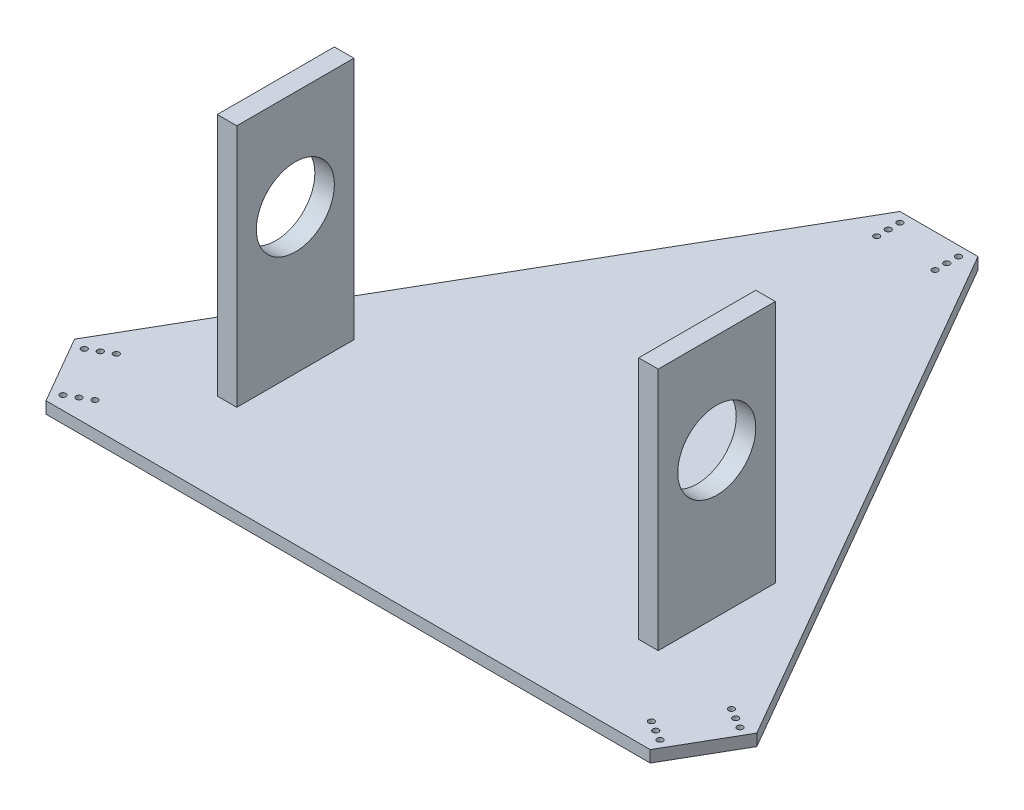
ISO-10303-21;
HEADER;
FILE_DESCRIPTION(('STEP AP214'),'2;1');
FILE_NAME('part.step','',(''),(''),'','','');
FILE_SCHEMA(('AUTOMOTIVE_DESIGN { 1 0 10303 214 1 1 1 1 }'));
ENDSEC;
DATA;
#1=APPLICATION_CONTEXT('core data for automotive mechanical design processes');
#2=APPLICATION_PROTOCOL_DEFINITION('international standard','automotive_design',2000,#1);
#3=PRODUCT_CONTEXT('',#1,'mechanical');
#4=PRODUCT('Part','Part','',(#3));
#5=PRODUCT_RELATED_PRODUCT_CATEGORY('part','',(#4));
#6=PRODUCT_DEFINITION_FORMATION('','',#4);
#7=PRODUCT_DEFINITION_CONTEXT('part definition',#1,'design');
#8=PRODUCT_DEFINITION('design','',#6,#7);
#9=PRODUCT_DEFINITION_SHAPE('','',#8);
#10=(LENGTH_UNIT() NAMED_UNIT(*) SI_UNIT(.MILLI.,.METRE.));
#11=(NAMED_UNIT(*) PLANE_ANGLE_UNIT() SI_UNIT($,.RADIAN.));
#12=(NAMED_UNIT(*) SI_UNIT($,.STERADIAN.) SOLID_ANGLE_UNIT());
#13=UNCERTAINTY_MEASURE_WITH_UNIT(LENGTH_MEASURE(1.E-05),#10,'distance_accuracy_value','');
#14=(GEOMETRIC_REPRESENTATION_CONTEXT(3) GLOBAL_UNCERTAINTY_ASSIGNED_CONTEXT((#13)) GLOBAL_UNIT_ASSIGNED_CONTEXT((#10,
#11,#12)) REPRESENTATION_CONTEXT('',''));
#15=CARTESIAN_POINT('',(0.,0.,0.));
#16=DIRECTION('',(0.,0.,1.));
#17=DIRECTION('',(1.,0.,0.));
#18=AXIS2_PLACEMENT_3D('',#15,#16,#17);
#19=CARTESIAN_POINT('',(0.,6.,0.));
#20=DIRECTION('',(0.,1.,0.));
#21=DIRECTION('',(0.,0.,1.));
#22=AXIS2_PLACEMENT_3D('',#19,#20,#21);
#23=PLANE('',#22);
#24=DIRECTION('',(1.,0.,0.));
#25=VECTOR('',#24,1.);
#26=CARTESIAN_POINT('',(103.,6.,6.54767863978529));
#27=LINE('',#26,#25);
#28=CARTESIAN_POINT('',(103.,6.,6.54767863978529));
#29=VERTEX_POINT('',#28);
#30=CARTESIAN_POINT('',(113.,6.,6.54767863978528));
#31=VERTEX_POINT('',#30);
#32=EDGE_CURVE('E141',#29,#31,#27,.T.);
#33=ORIENTED_EDGE('',*,*,#32,.T.);
#34=DIRECTION('',(0.,0.,1.));
#35=VECTOR('',#34,1.);
#36=CARTESIAN_POINT('',(113.,6.,6.54767863978528));
#37=LINE('',#36,#35);
#38=CARTESIAN_POINT('',(113.,6.,66.5476786397853));
#39=VERTEX_POINT('',#38);
#40=EDGE_CURVE('E180',#31,#39,#37,.T.);
#41=ORIENTED_EDGE('',*,*,#40,.T.);
#42=DIRECTION('',(1.,0.,0.));
#43=VECTOR('',#42,1.);
#44=CARTESIAN_POINT('',(103.,6.,66.5476786397853));
#45=LINE('',#44,#43);
#46=CARTESIAN_POINT('',(103.,6.,66.5476786397853));
#47=VERTEX_POINT('',#46);
#48=EDGE_CURVE('E182',#47,#39,#45,.T.);
#49=ORIENTED_EDGE('',*,*,#48,.F.);
#50=DIRECTION('',(0.,0.,1.));
#51=VECTOR('',#50,1.);
#52=CARTESIAN_POINT('',(103.,6.,6.54767863978529));
#53=LINE('',#52,#51);
#54=EDGE_CURVE('E171',#29,#47,#53,.T.);
#55=ORIENTED_EDGE('',*,*,#54,.F.);
#56=EDGE_LOOP('',(#33,#41,#49,#55));
#57=FACE_BOUND('',#56,.T.);
#58=CARTESIAN_POINT('',(-157.633283992223,6.,73.6891108704658));
#59=DIRECTION('',(0.,1.,0.));
#60=DIRECTION('',(0.,0.,1.));
#61=AXIS2_PLACEMENT_3D('',#58,#59,#60);
#62=CIRCLE('',#61,1.5);
#63=CARTESIAN_POINT('',(-157.633283992223,6.,75.1891108704658));
#64=VERTEX_POINT('',#63);
#65=EDGE_CURVE('E190',#64,#64,#62,.T.);
#66=ORIENTED_EDGE('',*,*,#65,.F.);
#67=EDGE_LOOP('',(#66));
#68=FACE_BOUND('',#67,.T.);
#69=CARTESIAN_POINT('',(-162.829436414929,6.,76.6891108704658));
#70=DIRECTION('',(0.,1.,0.));
#71=DIRECTION('',(0.,0.,1.));
#72=AXIS2_PLACEMENT_3D('',#69,#70,#71);
#73=CIRCLE('',#72,1.5);
#74=CARTESIAN_POINT('',(-162.829436414929,6.,78.1891108704658));
#75=VERTEX_POINT('',#74);
#76=EDGE_CURVE('E202',#75,#75,#73,.T.);
#77=ORIENTED_EDGE('',*,*,#76,.F.);
#78=EDGE_LOOP('',(#77));
#79=FACE_BOUND('',#78,.T.);
#80=CARTESIAN_POINT('',(-142.633283992223,6.,99.6698729839988));
#81=DIRECTION('',(0.,1.,0.));
#82=DIRECTION('',(0.,0.,1.));
#83=AXIS2_PLACEMENT_3D('',#80,#81,#82);
#84=CIRCLE('',#83,1.5);
#85=CARTESIAN_POINT('',(-142.633283992223,6.,101.169872983999));
#86=VERTEX_POINT('',#85);
#87=EDGE_CURVE('E208',#86,#86,#84,.T.);
#88=ORIENTED_EDGE('',*,*,#87,.F.);
#89=EDGE_LOOP('',(#88));
#90=FACE_BOUND('',#89,.T.);
#91=CARTESIAN_POINT('',(-147.829436414929,6.,102.669872983999));
#92=DIRECTION('',(0.,1.,0.));
#93=DIRECTION('',(0.,0.,1.));
#94=AXIS2_PLACEMENT_3D('',#91,#92,#93);
#95=CIRCLE('',#94,1.5);
#96=CARTESIAN_POINT('',(-147.829436414929,6.,104.169872983999));
#97=VERTEX_POINT('',#96);
#98=EDGE_CURVE('E214',#97,#97,#95,.T.);
#99=ORIENTED_EDGE('',*,*,#98,.F.);
#100=EDGE_LOOP('',(#99));
#101=FACE_BOUND('',#100,.T.);
#102=CARTESIAN_POINT('',(-153.025588837636,6.,105.669872983999));
#103=DIRECTION('',(0.,1.,0.));
#104=DIRECTION('',(0.,0.,1.));
#105=AXIS2_PLACEMENT_3D('',#102,#103,#104);
#106=CIRCLE('',#105,1.5);
#107=CARTESIAN_POINT('',(-153.025588837636,6.,107.169872983999));
#108=VERTEX_POINT('',#107);
#109=EDGE_CURVE('E220',#108,#108,#106,.T.);
#110=ORIENTED_EDGE('',*,*,#109,.F.);
#111=EDGE_LOOP('',(#110));
#112=FACE_BOUND('',#111,.T.);
#113=CARTESIAN_POINT('',(-168.025588837636,6.,79.6891108704658));
#114=DIRECTION('',(0.,1.,0.));
#115=DIRECTION('',(0.,0.,1.));
#116=AXIS2_PLACEMENT_3D('',#113,#114,#115);
#117=CIRCLE('',#116,1.5);
#118=CARTESIAN_POINT('',(-168.025588837636,6.,81.1891108704659));
#119=VERTEX_POINT('',#118);
#120=EDGE_CURVE('E226',#119,#119,#117,.T.);
#121=ORIENTED_EDGE('',*,*,#120,.F.);
#122=EDGE_LOOP('',(#121));
#123=FACE_BOUND('',#122,.T.);
#124=CARTESIAN_POINT('',(142.633283992223,6.,99.669872983999));
#125=DIRECTION('',(0.,1.,0.));
#126=DIRECTION('',(0.,0.,1.));
#127=AXIS2_PLACEMENT_3D('',#124,#125,#126);
#128=CIRCLE('',#127,1.5);
#129=CARTESIAN_POINT('',(142.633283992223,6.,101.169872983999));
#130=VERTEX_POINT('',#129);
#131=EDGE_CURVE('E232',#130,#130,#128,.T.);
#132=ORIENTED_EDGE('',*,*,#131,.F.);
#133=EDGE_LOOP('',(#132));
#134=FACE_BOUND('',#133,.T.);
#135=CARTESIAN_POINT('',(147.829436414929,6.,102.669872983999));
#136=DIRECTION('',(0.,1.,0.));
#137=DIRECTION('',(0.,0.,1.));
#138=AXIS2_PLACEMENT_3D('',#135,#136,#137);
#139=CIRCLE('',#138,1.5);
#140=CARTESIAN_POINT('',(147.829436414929,6.,104.169872983999));
#141=VERTEX_POINT('',#140);
#142=EDGE_CURVE('E238',#141,#141,#139,.T.);
#143=ORIENTED_EDGE('',*,*,#142,.F.);
#144=EDGE_LOOP('',(#143));
#145=FACE_BOUND('',#144,.T.);
#146=CARTESIAN_POINT('',(157.633283992223,6.,73.6891108704658));
#147=DIRECTION('',(0.,1.,0.));
#148=DIRECTION('',(0.,0.,1.));
#149=AXIS2_PLACEMENT_3D('',#146,#147,#148);
#150=CIRCLE('',#149,1.5);
#151=CARTESIAN_POINT('',(157.633283992223,6.,75.1891108704658));
#152=VERTEX_POINT('',#151);
#153=EDGE_CURVE('E244',#152,#152,#150,.T.);
#154=ORIENTED_EDGE('',*,*,#153,.F.);
#155=EDGE_LOOP('',(#154));
#156=FACE_BOUND('',#155,.T.);
#157=CARTESIAN_POINT('',(162.829436414929,6.,76.6891108704657));
#158=DIRECTION('',(0.,1.,0.));
#159=DIRECTION('',(0.,0.,1.));
#160=AXIS2_PLACEMENT_3D('',#157,#158,#159);
#161=CIRCLE('',#160,1.5);
#162=CARTESIAN_POINT('',(162.829436414929,6.,78.1891108704657));
#163=VERTEX_POINT('',#162);
#164=EDGE_CURVE('E250',#163,#163,#161,.T.);
#165=ORIENTED_EDGE('',*,*,#164,.F.);
#166=EDGE_LOOP('',(#165));
#167=FACE_BOUND('',#166,.T.);
#168=CARTESIAN_POINT('',(168.025588837636,6.,79.6891108704656));
#169=DIRECTION('',(0.,1.,0.));
#170=DIRECTION('',(0.,0.,1.));
#171=AXIS2_PLACEMENT_3D('',#168,#169,#170);
#172=CIRCLE('',#171,1.5);
#173=CARTESIAN_POINT('',(168.025588837636,6.,81.1891108704656));
#174=VERTEX_POINT('',#173);
#175=EDGE_CURVE('E256',#174,#174,#172,.T.);
#176=ORIENTED_EDGE('',*,*,#175,.F.);
#177=EDGE_LOOP('',(#176));
#178=FACE_BOUND('',#177,.T.);
#179=CARTESIAN_POINT('',(153.025588837636,6.,105.669872983999));
#180=DIRECTION('',(0.,1.,0.));
#181=DIRECTION('',(0.,0.,1.));
#182=AXIS2_PLACEMENT_3D('',#179,#180,#181);
#183=CIRCLE('',#182,1.5);
#184=CARTESIAN_POINT('',(153.025588837636,6.,107.169872983999));
#185=VERTEX_POINT('',#184);
#186=EDGE_CURVE('E262',#185,#185,#183,.T.);
#187=ORIENTED_EDGE('',*,*,#186,.F.);
#188=EDGE_LOOP('',(#187));
#189=FACE_BOUND('',#188,.T.);
#190=CARTESIAN_POINT('',(15.0000000000001,6.,-173.358983854465));
#191=DIRECTION('',(0.,1.,0.));
#192=DIRECTION('',(0.,0.,1.));
#193=AXIS2_PLACEMENT_3D('',#190,#191,#192);
#194=CIRCLE('',#193,1.5);
#195=CARTESIAN_POINT('',(15.0000000000001,6.,-171.858983854465));
#196=VERTEX_POINT('',#195);
#197=EDGE_CURVE('E268',#196,#196,#194,.T.);
#198=ORIENTED_EDGE('',*,*,#197,.F.);
#199=EDGE_LOOP('',(#198));
#200=FACE_BOUND('',#199,.T.);
#201=CARTESIAN_POINT('',(15.0000000000001,6.,-179.358983854465));
#202=DIRECTION('',(0.,1.,0.));
#203=DIRECTION('',(0.,0.,1.));
#204=AXIS2_PLACEMENT_3D('',#201,#202,#203);
#205=CIRCLE('',#204,1.5);
#206=CARTESIAN_POINT('',(15.0000000000001,6.,-177.858983854465));
#207=VERTEX_POINT('',#206);
#208=EDGE_CURVE('E274',#207,#207,#205,.T.);
#209=ORIENTED_EDGE('',*,*,#208,.F.);
#210=EDGE_LOOP('',(#209));
#211=FACE_BOUND('',#210,.T.);
#212=CARTESIAN_POINT('',(-14.9999999999999,6.,-173.358983854465));
#213=DIRECTION('',(0.,1.,0.));
#214=DIRECTION('',(0.,0.,1.));
#215=AXIS2_PLACEMENT_3D('',#212,#213,#214);
#216=CIRCLE('',#215,1.5);
#217=CARTESIAN_POINT('',(-14.9999999999999,6.,-171.858983854465));
#218=VERTEX_POINT('',#217);
#219=EDGE_CURVE('E280',#218,#218,#216,.T.);
#220=ORIENTED_EDGE('',*,*,#219,.F.);
#221=EDGE_LOOP('',(#220));
#222=FACE_BOUND('',#221,.T.);
#223=CARTESIAN_POINT('',(-14.9999999999999,6.,-179.358983854465));
#224=DIRECTION('',(0.,1.,0.));
#225=DIRECTION('',(0.,0.,1.));
#226=AXIS2_PLACEMENT_3D('',#223,#224,#225);
#227=CIRCLE('',#226,1.5);
#228=CARTESIAN_POINT('',(-14.9999999999999,6.,-177.858983854465));
#229=VERTEX_POINT('',#228);
#230=EDGE_CURVE('E286',#229,#229,#227,.T.);
#231=ORIENTED_EDGE('',*,*,#230,.F.);
#232=EDGE_LOOP('',(#231));
#233=FACE_BOUND('',#232,.T.);
#234=CARTESIAN_POINT('',(-15.,6.,-185.358983854464));
#235=DIRECTION('',(0.,1.,0.));
#236=DIRECTION('',(0.,0.,1.));
#237=AXIS2_PLACEMENT_3D('',#234,#235,#236);
#238=CIRCLE('',#237,1.5);
#239=CARTESIAN_POINT('',(-15.,6.,-183.858983854464));
#240=VERTEX_POINT('',#239);
#241=EDGE_CURVE('E292',#240,#240,#238,.T.);
#242=ORIENTED_EDGE('',*,*,#241,.F.);
#243=EDGE_LOOP('',(#242));
#244=FACE_BOUND('',#243,.T.);
#245=CARTESIAN_POINT('',(15.,6.,-185.358983854465));
#246=DIRECTION('',(0.,1.,0.));
#247=DIRECTION('',(0.,0.,1.));
#248=AXIS2_PLACEMENT_3D('',#245,#246,#247);
#249=CIRCLE('',#248,1.5);
#250=CARTESIAN_POINT('',(15.,6.,-183.858983854465));
#251=VERTEX_POINT('',#250);
#252=EDGE_CURVE('E298',#251,#251,#249,.T.);
#253=ORIENTED_EDGE('',*,*,#252,.F.);
#254=EDGE_LOOP('',(#253));
#255=FACE_BOUND('',#254,.T.);
#256=DIRECTION('',(1.,0.,0.));
#257=VECTOR('',#256,1.);
#258=CARTESIAN_POINT('',(-20.,6.,-190.358983854465));
#259=LINE('',#258,#257);
#260=CARTESIAN_POINT('',(-20.,6.,-190.358983854465));
#261=VERTEX_POINT('',#260);
#262=CARTESIAN_POINT('',(20.,6.,-190.358983854465));
#263=VERTEX_POINT('',#262);
#264=EDGE_CURVE('E307',#261,#263,#259,.T.);
#265=ORIENTED_EDGE('',*,*,#264,.F.);
#266=DIRECTION('',(-0.5,0.,0.866025403784439));
#267=VECTOR('',#266,1.);
#268=CARTESIAN_POINT('',(-20.,6.,-190.358983854465));
#269=LINE('',#268,#267);
#270=CARTESIAN_POINT('',(-174.855715856558,6.,77.8589838515431));
#271=VERTEX_POINT('',#270);
#272=EDGE_CURVE('E321',#261,#271,#269,.T.);
#273=ORIENTED_EDGE('',*,*,#272,.T.);
#274=DIRECTION('',(-0.499999999999999,0.,-0.866025403784439));
#275=VECTOR('',#274,1.);
#276=CARTESIAN_POINT('',(-154.855715856558,6.,112.500000002921));
#277=LINE('',#276,#275);
#278=CARTESIAN_POINT('',(-154.855715856558,6.,112.500000002921));
#279=VERTEX_POINT('',#278);
#280=EDGE_CURVE('E318',#279,#271,#277,.T.);
#281=ORIENTED_EDGE('',*,*,#280,.F.);
#282=DIRECTION('',(1.,0.,0.));
#283=VECTOR('',#282,1.);
#284=CARTESIAN_POINT('',(-154.855715856558,6.,112.500000002921));
#285=LINE('',#284,#283);
#286=CARTESIAN_POINT('',(154.855715856558,6.,112.500000002921));
#287=VERTEX_POINT('',#286);
#288=EDGE_CURVE('E316',#279,#287,#285,.T.);
#289=ORIENTED_EDGE('',*,*,#288,.T.);
#290=DIRECTION('',(-0.500000000000001,0.,0.866025403784438));
#291=VECTOR('',#290,1.);
#292=CARTESIAN_POINT('',(174.855715856558,6.,77.8589838515431));
#293=LINE('',#292,#291);
#294=CARTESIAN_POINT('',(174.855715856558,6.,77.8589838515431));
#295=VERTEX_POINT('',#294);
#296=EDGE_CURVE('E313',#295,#287,#293,.T.);
#297=ORIENTED_EDGE('',*,*,#296,.F.);
#298=DIRECTION('',(-0.5,0.,-0.866025403784439));
#299=VECTOR('',#298,1.);
#300=CARTESIAN_POINT('',(174.855715856558,6.,77.8589838515431));
#301=LINE('',#300,#299);
#302=EDGE_CURVE('E310',#295,#263,#301,.T.);
#303=ORIENTED_EDGE('',*,*,#302,.T.);
#304=EDGE_LOOP('',(#265,#273,#281,#289,#297,#303));
#305=FACE_BOUND('',#304,.T.);
#306=DIRECTION('',(0.,0.,1.));
#307=VECTOR('',#306,1.);
#308=CARTESIAN_POINT('',(-113.,6.,6.54767863978528));
#309=LINE('',#308,#307);
#310=CARTESIAN_POINT('',(-113.,6.,6.54767863978528));
#311=VERTEX_POINT('',#310);
#312=CARTESIAN_POINT('',(-113.,6.,66.5476786397853));
#313=VERTEX_POINT('',#312);
#314=EDGE_CURVE('E52',#311,#313,#309,.T.);
#315=ORIENTED_EDGE('',*,*,#314,.F.);
#316=DIRECTION('',(-1.,0.,0.));
#317=VECTOR('',#316,1.);
#318=CARTESIAN_POINT('',(-103.,6.,6.54767863978529));
#319=LINE('',#318,#317);
#320=CARTESIAN_POINT('',(-103.,6.,6.54767863978529));
#321=VERTEX_POINT('',#320);
#322=EDGE_CURVE('E134',#321,#311,#319,.T.);
#323=ORIENTED_EDGE('',*,*,#322,.F.);
#324=DIRECTION('',(0.,0.,1.));
#325=VECTOR('',#324,1.);
#326=CARTESIAN_POINT('',(-103.,6.,6.54767863978529));
#327=LINE('',#326,#325);
#328=CARTESIAN_POINT('',(-103.,6.,66.5476786397853));
#329=VERTEX_POINT('',#328);
#330=EDGE_CURVE('E137',#321,#329,#327,.T.);
#331=ORIENTED_EDGE('',*,*,#330,.T.);
#332=DIRECTION('',(-1.,0.,0.));
#333=VECTOR('',#332,1.);
#334=CARTESIAN_POINT('',(-103.,6.,66.5476786397853));
#335=LINE('',#334,#333);
#336=EDGE_CURVE('E57',#329,#313,#335,.T.);
#337=ORIENTED_EDGE('',*,*,#336,.T.);
#338=EDGE_LOOP('',(#315,#323,#331,#337));
#339=FACE_BOUND('',#338,.T.);
#340=ADVANCED_FACE('F35',(#57,#68,#79,#90,#101,#112,#123,#134,#145,#156,#167,#178,#189,#200,
#211,#222,#233,#244,#255,#305,#339),#23,.T.);
#341=CARTESIAN_POINT('',(-20.,6.,-190.358983854465));
#342=DIRECTION('',(0.,0.,-1.));
#343=DIRECTION('',(-1.,0.,0.));
#344=AXIS2_PLACEMENT_3D('',#341,#342,#343);
#345=PLANE('',#344);
#346=DIRECTION('',(1.,0.,0.));
#347=VECTOR('',#346,1.);
#348=CARTESIAN_POINT('',(-20.,0.,-190.358983854465));
#349=LINE('',#348,#347);
#350=CARTESIAN_POINT('',(-20.,0.,-190.358983854465));
#351=VERTEX_POINT('',#350);
#352=CARTESIAN_POINT('',(20.,0.,-190.358983854465));
#353=VERTEX_POINT('',#352);
#354=EDGE_CURVE('E304',#351,#353,#349,.T.);
#355=ORIENTED_EDGE('',*,*,#354,.F.);
#356=DIRECTION('',(0.,-1.,0.));
#357=VECTOR('',#356,1.);
#358=CARTESIAN_POINT('',(-20.,6.,-190.358983854465));
#359=LINE('',#358,#357);
#360=EDGE_CURVE('E11',#261,#351,#359,.T.);
#361=ORIENTED_EDGE('',*,*,#360,.F.);
#362=ORIENTED_EDGE('',*,*,#264,.T.);
#363=DIRECTION('',(0.,-1.,0.));
#364=VECTOR('',#363,1.);
#365=CARTESIAN_POINT('',(20.,6.,-190.358983854465));
#366=LINE('',#365,#364);
#367=EDGE_CURVE('E323',#263,#353,#366,.T.);
#368=ORIENTED_EDGE('',*,*,#367,.T.);
#369=EDGE_LOOP('',(#355,#361,#362,#368));
#370=FACE_BOUND('',#369,.T.);
#371=ADVANCED_FACE('F37',(#370),#345,.T.);
#372=CARTESIAN_POINT('',(-20.,6.,-190.358983854465));
#373=DIRECTION('',(0.866025403784439,0.,0.5));
#374=DIRECTION('',(0.5,0.,-0.866025403784439));
#375=AXIS2_PLACEMENT_3D('',#372,#373,#374);
#376=PLANE('',#375);
#377=DIRECTION('',(-0.5,0.,0.866025403784439));
#378=VECTOR('',#377,1.);
#379=CARTESIAN_POINT('',(-20.,0.,-190.358983854465));
#380=LINE('',#379,#378);
#381=CARTESIAN_POINT('',(-174.855715856558,0.,77.8589838515431));
#382=VERTEX_POINT('',#381);
#383=EDGE_CURVE('E311',#351,#382,#380,.T.);
#384=ORIENTED_EDGE('',*,*,#383,.T.);
#385=DIRECTION('',(0.,-1.,0.));
#386=VECTOR('',#385,1.);
#387=CARTESIAN_POINT('',(-174.855715856558,6.,77.8589838515431));
#388=LINE('',#387,#386);
#389=EDGE_CURVE('E44',#271,#382,#388,.T.);
#390=ORIENTED_EDGE('',*,*,#389,.F.);
#391=ORIENTED_EDGE('',*,*,#272,.F.);
#392=ORIENTED_EDGE('',*,*,#360,.T.);
#393=EDGE_LOOP('',(#384,#390,#391,#392));
#394=FACE_BOUND('',#393,.T.);
#395=ADVANCED_FACE('F362',(#394),#376,.F.);
#396=CARTESIAN_POINT('',(-154.855715856558,6.,112.500000002921));
#397=DIRECTION('',(-0.866025403784439,0.,0.499999999999999));
#398=DIRECTION('',(0.499999999999999,0.,0.866025403784439));
#399=AXIS2_PLACEMENT_3D('',#396,#397,#398);
#400=PLANE('',#399);
#401=DIRECTION('',(-0.499999999999999,0.,-0.866025403784439));
#402=VECTOR('',#401,1.);
#403=CARTESIAN_POINT('',(-154.855715856558,0.,112.500000002921));
#404=LINE('',#403,#402);
#405=CARTESIAN_POINT('',(-154.855715856558,0.,112.500000002921));
#406=VERTEX_POINT('',#405);
#407=EDGE_CURVE('E335',#406,#382,#404,.T.);
#408=ORIENTED_EDGE('',*,*,#407,.F.);
#409=DIRECTION('',(0.,-1.,0.));
#410=VECTOR('',#409,1.);
#411=CARTESIAN_POINT('',(-154.855715856558,6.,112.500000002921));
#412=LINE('',#411,#410);
#413=EDGE_CURVE('E341',#279,#406,#412,.T.);
#414=ORIENTED_EDGE('',*,*,#413,.F.);
#415=ORIENTED_EDGE('',*,*,#280,.T.);
#416=ORIENTED_EDGE('',*,*,#389,.T.);
#417=EDGE_LOOP('',(#408,#414,#415,#416));
#418=FACE_BOUND('',#417,.T.);
#419=ADVANCED_FACE('F373',(#418),#400,.T.);
#420=CARTESIAN_POINT('',(-154.855715856558,6.,112.500000002921));
#421=DIRECTION('',(0.,0.,-1.));
#422=DIRECTION('',(-1.,0.,0.));
#423=AXIS2_PLACEMENT_3D('',#420,#421,#422);
#424=PLANE('',#423);
#425=DIRECTION('',(1.,0.,0.));
#426=VECTOR('',#425,1.);
#427=CARTESIAN_POINT('',(-154.855715856558,0.,112.500000002921));
#428=LINE('',#427,#426);
#429=CARTESIAN_POINT('',(154.855715856558,0.,112.500000002921));
#430=VERTEX_POINT('',#429);
#431=EDGE_CURVE('E332',#406,#430,#428,.T.);
#432=ORIENTED_EDGE('',*,*,#431,.T.);
#433=DIRECTION('',(0.,-1.,0.));
#434=VECTOR('',#433,1.);
#435=CARTESIAN_POINT('',(154.855715856558,6.,112.500000002921));
#436=LINE('',#435,#434);
#437=EDGE_CURVE('E343',#287,#430,#436,.T.);
#438=ORIENTED_EDGE('',*,*,#437,.F.);
#439=ORIENTED_EDGE('',*,*,#288,.F.);
#440=ORIENTED_EDGE('',*,*,#413,.T.);
#441=EDGE_LOOP('',(#432,#438,#439,#440));
#442=FACE_BOUND('',#441,.T.);
#443=ADVANCED_FACE('F374',(#442),#424,.F.);
#444=CARTESIAN_POINT('',(174.855715856558,6.,77.8589838515431));
#445=DIRECTION('',(0.866025403784438,0.,0.500000000000001));
#446=DIRECTION('',(0.500000000000001,0.,-0.866025403784438));
#447=AXIS2_PLACEMENT_3D('',#444,#445,#446);
#448=PLANE('',#447);
#449=DIRECTION('',(-0.500000000000001,0.,0.866025403784438));
#450=VECTOR('',#449,1.);
#451=CARTESIAN_POINT('',(174.855715856558,0.,77.8589838515431));
#452=LINE('',#451,#450);
#453=CARTESIAN_POINT('',(174.855715856558,0.,77.8589838515431));
#454=VERTEX_POINT('',#453);
#455=EDGE_CURVE('E329',#454,#430,#452,.T.);
#456=ORIENTED_EDGE('',*,*,#455,.F.);
#457=DIRECTION('',(0.,-1.,0.));
#458=VECTOR('',#457,1.);
#459=CARTESIAN_POINT('',(174.855715856558,6.,77.8589838515431));
#460=LINE('',#459,#458);
#461=EDGE_CURVE('E345',#295,#454,#460,.T.);
#462=ORIENTED_EDGE('',*,*,#461,.F.);
#463=ORIENTED_EDGE('',*,*,#296,.T.);
#464=ORIENTED_EDGE('',*,*,#437,.T.);
#465=EDGE_LOOP('',(#456,#462,#463,#464));
#466=FACE_BOUND('',#465,.T.);
#467=ADVANCED_FACE('F370',(#466),#448,.T.);
#468=CARTESIAN_POINT('',(174.855715856558,6.,77.8589838515431));
#469=DIRECTION('',(-0.866025403784438,0.,0.5));
#470=DIRECTION('',(0.5,0.,0.866025403784439));
#471=AXIS2_PLACEMENT_3D('',#468,#469,#470);
#472=PLANE('',#471);
#473=DIRECTION('',(-0.5,0.,-0.866025403784439));
#474=VECTOR('',#473,1.);
#475=CARTESIAN_POINT('',(174.855715856558,0.,77.8589838515431));
#476=LINE('',#475,#474);
#477=EDGE_CURVE('E326',#454,#353,#476,.T.);
#478=ORIENTED_EDGE('',*,*,#477,.T.);
#479=ORIENTED_EDGE('',*,*,#367,.F.);
#480=ORIENTED_EDGE('',*,*,#302,.F.);
#481=ORIENTED_EDGE('',*,*,#461,.T.);
#482=EDGE_LOOP('',(#478,#479,#480,#481));
#483=FACE_BOUND('',#482,.T.);
#484=ADVANCED_FACE('F353',(#483),#472,.F.);
#485=CARTESIAN_POINT('',(0.,0.,0.));
#486=DIRECTION('',(0.,1.,0.));
#487=DIRECTION('',(0.,0.,1.));
#488=AXIS2_PLACEMENT_3D('',#485,#486,#487);
#489=PLANE('',#488);
#490=CARTESIAN_POINT('',(-157.633283992223,0.,73.6891108704658));
#491=DIRECTION('',(0.,1.,0.));
#492=DIRECTION('',(0.,0.,1.));
#493=AXIS2_PLACEMENT_3D('',#490,#491,#492);
#494=CIRCLE('',#493,1.5);
#495=CARTESIAN_POINT('',(-157.633283992223,0.,75.1891108704658));
#496=VERTEX_POINT('',#495);
#497=EDGE_CURVE('E199',#496,#496,#494,.T.);
#498=ORIENTED_EDGE('',*,*,#497,.T.);
#499=EDGE_LOOP('',(#498));
#500=FACE_BOUND('',#499,.T.);
#501=CARTESIAN_POINT('',(-162.829436414929,0.,76.6891108704658));
#502=DIRECTION('',(0.,1.,0.));
#503=DIRECTION('',(0.,0.,1.));
#504=AXIS2_PLACEMENT_3D('',#501,#502,#503);
#505=CIRCLE('',#504,1.5);
#506=CARTESIAN_POINT('',(-162.829436414929,0.,78.1891108704658));
#507=VERTEX_POINT('',#506);
#508=EDGE_CURVE('E205',#507,#507,#505,.T.);
#509=ORIENTED_EDGE('',*,*,#508,.T.);
#510=EDGE_LOOP('',(#509));
#511=FACE_BOUND('',#510,.T.);
#512=CARTESIAN_POINT('',(-142.633283992223,0.,99.6698729839988));
#513=DIRECTION('',(0.,1.,0.));
#514=DIRECTION('',(0.,0.,1.));
#515=AXIS2_PLACEMENT_3D('',#512,#513,#514);
#516=CIRCLE('',#515,1.5);
#517=CARTESIAN_POINT('',(-142.633283992223,0.,101.169872983999));
#518=VERTEX_POINT('',#517);
#519=EDGE_CURVE('E211',#518,#518,#516,.T.);
#520=ORIENTED_EDGE('',*,*,#519,.T.);
#521=EDGE_LOOP('',(#520));
#522=FACE_BOUND('',#521,.T.);
#523=CARTESIAN_POINT('',(-147.829436414929,0.,102.669872983999));
#524=DIRECTION('',(0.,1.,0.));
#525=DIRECTION('',(0.,0.,1.));
#526=AXIS2_PLACEMENT_3D('',#523,#524,#525);
#527=CIRCLE('',#526,1.5);
#528=CARTESIAN_POINT('',(-147.829436414929,0.,104.169872983999));
#529=VERTEX_POINT('',#528);
#530=EDGE_CURVE('E217',#529,#529,#527,.T.);
#531=ORIENTED_EDGE('',*,*,#530,.T.);
#532=EDGE_LOOP('',(#531));
#533=FACE_BOUND('',#532,.T.);
#534=CARTESIAN_POINT('',(-153.025588837636,0.,105.669872983999));
#535=DIRECTION('',(0.,1.,0.));
#536=DIRECTION('',(0.,0.,1.));
#537=AXIS2_PLACEMENT_3D('',#534,#535,#536);
#538=CIRCLE('',#537,1.5);
#539=CARTESIAN_POINT('',(-153.025588837636,0.,107.169872983999));
#540=VERTEX_POINT('',#539);
#541=EDGE_CURVE('E223',#540,#540,#538,.T.);
#542=ORIENTED_EDGE('',*,*,#541,.T.);
#543=EDGE_LOOP('',(#542));
#544=FACE_BOUND('',#543,.T.);
#545=CARTESIAN_POINT('',(-168.025588837636,0.,79.6891108704658));
#546=DIRECTION('',(0.,1.,0.));
#547=DIRECTION('',(0.,0.,1.));
#548=AXIS2_PLACEMENT_3D('',#545,#546,#547);
#549=CIRCLE('',#548,1.5);
#550=CARTESIAN_POINT('',(-168.025588837636,0.,81.1891108704659));
#551=VERTEX_POINT('',#550);
#552=EDGE_CURVE('E229',#551,#551,#549,.T.);
#553=ORIENTED_EDGE('',*,*,#552,.T.);
#554=EDGE_LOOP('',(#553));
#555=FACE_BOUND('',#554,.T.);
#556=CARTESIAN_POINT('',(142.633283992223,0.,99.669872983999));
#557=DIRECTION('',(0.,1.,0.));
#558=DIRECTION('',(0.,0.,1.));
#559=AXIS2_PLACEMENT_3D('',#556,#557,#558);
#560=CIRCLE('',#559,1.5);
#561=CARTESIAN_POINT('',(142.633283992223,0.,101.169872983999));
#562=VERTEX_POINT('',#561);
#563=EDGE_CURVE('E235',#562,#562,#560,.T.);
#564=ORIENTED_EDGE('',*,*,#563,.T.);
#565=EDGE_LOOP('',(#564));
#566=FACE_BOUND('',#565,.T.);
#567=CARTESIAN_POINT('',(147.829436414929,0.,102.669872983999));
#568=DIRECTION('',(0.,1.,0.));
#569=DIRECTION('',(0.,0.,1.));
#570=AXIS2_PLACEMENT_3D('',#567,#568,#569);
#571=CIRCLE('',#570,1.5);
#572=CARTESIAN_POINT('',(147.829436414929,0.,104.169872983999));
#573=VERTEX_POINT('',#572);
#574=EDGE_CURVE('E241',#573,#573,#571,.T.);
#575=ORIENTED_EDGE('',*,*,#574,.T.);
#576=EDGE_LOOP('',(#575));
#577=FACE_BOUND('',#576,.T.);
#578=CARTESIAN_POINT('',(157.633283992223,0.,73.6891108704658));
#579=DIRECTION('',(0.,1.,0.));
#580=DIRECTION('',(0.,0.,1.));
#581=AXIS2_PLACEMENT_3D('',#578,#579,#580);
#582=CIRCLE('',#581,1.5);
#583=CARTESIAN_POINT('',(157.633283992223,0.,75.1891108704658));
#584=VERTEX_POINT('',#583);
#585=EDGE_CURVE('E247',#584,#584,#582,.T.);
#586=ORIENTED_EDGE('',*,*,#585,.T.);
#587=EDGE_LOOP('',(#586));
#588=FACE_BOUND('',#587,.T.);
#589=CARTESIAN_POINT('',(162.829436414929,0.,76.6891108704657));
#590=DIRECTION('',(0.,1.,0.));
#591=DIRECTION('',(0.,0.,1.));
#592=AXIS2_PLACEMENT_3D('',#589,#590,#591);
#593=CIRCLE('',#592,1.5);
#594=CARTESIAN_POINT('',(162.829436414929,0.,78.1891108704657));
#595=VERTEX_POINT('',#594);
#596=EDGE_CURVE('E253',#595,#595,#593,.T.);
#597=ORIENTED_EDGE('',*,*,#596,.T.);
#598=EDGE_LOOP('',(#597));
#599=FACE_BOUND('',#598,.T.);
#600=CARTESIAN_POINT('',(168.025588837636,0.,79.6891108704656));
#601=DIRECTION('',(0.,1.,0.));
#602=DIRECTION('',(0.,0.,1.));
#603=AXIS2_PLACEMENT_3D('',#600,#601,#602);
#604=CIRCLE('',#603,1.5);
#605=CARTESIAN_POINT('',(168.025588837636,0.,81.1891108704656));
#606=VERTEX_POINT('',#605);
#607=EDGE_CURVE('E259',#606,#606,#604,.T.);
#608=ORIENTED_EDGE('',*,*,#607,.T.);
#609=EDGE_LOOP('',(#608));
#610=FACE_BOUND('',#609,.T.);
#611=CARTESIAN_POINT('',(153.025588837636,0.,105.669872983999));
#612=DIRECTION('',(0.,1.,0.));
#613=DIRECTION('',(0.,0.,1.));
#614=AXIS2_PLACEMENT_3D('',#611,#612,#613);
#615=CIRCLE('',#614,1.5);
#616=CARTESIAN_POINT('',(153.025588837636,0.,107.169872983999));
#617=VERTEX_POINT('',#616);
#618=EDGE_CURVE('E265',#617,#617,#615,.T.);
#619=ORIENTED_EDGE('',*,*,#618,.T.);
#620=EDGE_LOOP('',(#619));
#621=FACE_BOUND('',#620,.T.);
#622=CARTESIAN_POINT('',(15.0000000000001,0.,-173.358983854465));
#623=DIRECTION('',(0.,1.,0.));
#624=DIRECTION('',(0.,0.,1.));
#625=AXIS2_PLACEMENT_3D('',#622,#623,#624);
#626=CIRCLE('',#625,1.5);
#627=CARTESIAN_POINT('',(15.0000000000001,0.,-171.858983854465));
#628=VERTEX_POINT('',#627);
#629=EDGE_CURVE('E271',#628,#628,#626,.T.);
#630=ORIENTED_EDGE('',*,*,#629,.T.);
#631=EDGE_LOOP('',(#630));
#632=FACE_BOUND('',#631,.T.);
#633=CARTESIAN_POINT('',(15.0000000000001,0.,-179.358983854465));
#634=DIRECTION('',(0.,1.,0.));
#635=DIRECTION('',(0.,0.,1.));
#636=AXIS2_PLACEMENT_3D('',#633,#634,#635);
#637=CIRCLE('',#636,1.5);
#638=CARTESIAN_POINT('',(15.0000000000001,0.,-177.858983854465));
#639=VERTEX_POINT('',#638);
#640=EDGE_CURVE('E277',#639,#639,#637,.T.);
#641=ORIENTED_EDGE('',*,*,#640,.T.);
#642=EDGE_LOOP('',(#641));
#643=FACE_BOUND('',#642,.T.);
#644=CARTESIAN_POINT('',(-14.9999999999999,0.,-173.358983854465));
#645=DIRECTION('',(0.,1.,0.));
#646=DIRECTION('',(0.,0.,1.));
#647=AXIS2_PLACEMENT_3D('',#644,#645,#646);
#648=CIRCLE('',#647,1.5);
#649=CARTESIAN_POINT('',(-14.9999999999999,0.,-171.858983854465));
#650=VERTEX_POINT('',#649);
#651=EDGE_CURVE('E283',#650,#650,#648,.T.);
#652=ORIENTED_EDGE('',*,*,#651,.T.);
#653=EDGE_LOOP('',(#652));
#654=FACE_BOUND('',#653,.T.);
#655=CARTESIAN_POINT('',(-14.9999999999999,0.,-179.358983854465));
#656=DIRECTION('',(0.,1.,0.));
#657=DIRECTION('',(0.,0.,1.));
#658=AXIS2_PLACEMENT_3D('',#655,#656,#657);
#659=CIRCLE('',#658,1.5);
#660=CARTESIAN_POINT('',(-14.9999999999999,0.,-177.858983854465));
#661=VERTEX_POINT('',#660);
#662=EDGE_CURVE('E289',#661,#661,#659,.T.);
#663=ORIENTED_EDGE('',*,*,#662,.T.);
#664=EDGE_LOOP('',(#663));
#665=FACE_BOUND('',#664,.T.);
#666=CARTESIAN_POINT('',(-15.,0.,-185.358983854464));
#667=DIRECTION('',(0.,1.,0.));
#668=DIRECTION('',(0.,0.,1.));
#669=AXIS2_PLACEMENT_3D('',#666,#667,#668);
#670=CIRCLE('',#669,1.5);
#671=CARTESIAN_POINT('',(-15.,0.,-183.858983854464));
#672=VERTEX_POINT('',#671);
#673=EDGE_CURVE('E295',#672,#672,#670,.T.);
#674=ORIENTED_EDGE('',*,*,#673,.T.);
#675=EDGE_LOOP('',(#674));
#676=FACE_BOUND('',#675,.T.);
#677=CARTESIAN_POINT('',(15.,0.,-185.358983854465));
#678=DIRECTION('',(0.,1.,0.));
#679=DIRECTION('',(0.,0.,1.));
#680=AXIS2_PLACEMENT_3D('',#677,#678,#679);
#681=CIRCLE('',#680,1.5);
#682=CARTESIAN_POINT('',(15.,0.,-183.858983854465));
#683=VERTEX_POINT('',#682);
#684=EDGE_CURVE('E301',#683,#683,#681,.T.);
#685=ORIENTED_EDGE('',*,*,#684,.T.);
#686=EDGE_LOOP('',(#685));
#687=FACE_BOUND('',#686,.T.);
#688=ORIENTED_EDGE('',*,*,#354,.T.);
#689=ORIENTED_EDGE('',*,*,#477,.F.);
#690=ORIENTED_EDGE('',*,*,#455,.T.);
#691=ORIENTED_EDGE('',*,*,#431,.F.);
#692=ORIENTED_EDGE('',*,*,#407,.T.);
#693=ORIENTED_EDGE('',*,*,#383,.F.);
#694=EDGE_LOOP('',(#688,#689,#690,#691,#692,#693));
#695=FACE_BOUND('',#694,.T.);
#696=ADVANCED_FACE('F357',(#500,#511,#522,#533,#544,#555,#566,#577,#588,#599,#610,#621,#632,
#643,#654,#665,#676,#687,#695),#489,.F.);
#697=CARTESIAN_POINT('',(15.,0.,-185.358983854465));
#698=DIRECTION('',(0.,1.,0.));
#699=DIRECTION('',(0.,0.,1.));
#700=AXIS2_PLACEMENT_3D('',#697,#698,#699);
#701=CYLINDRICAL_SURFACE('',#700,1.5);
#702=ORIENTED_EDGE('',*,*,#684,.F.);
#703=EDGE_LOOP('',(#702));
#704=FACE_BOUND('',#703,.T.);
#705=ORIENTED_EDGE('',*,*,#252,.T.);
#706=EDGE_LOOP('',(#705));
#707=FACE_BOUND('',#706,.T.);
#708=ADVANCED_FACE('F392',(#704,#707),#701,.F.);
#709=CARTESIAN_POINT('',(-15.,0.,-185.358983854464));
#710=DIRECTION('',(0.,1.,0.));
#711=DIRECTION('',(0.,0.,1.));
#712=AXIS2_PLACEMENT_3D('',#709,#710,#711);
#713=CYLINDRICAL_SURFACE('',#712,1.5);
#714=ORIENTED_EDGE('',*,*,#673,.F.);
#715=EDGE_LOOP('',(#714));
#716=FACE_BOUND('',#715,.T.);
#717=ORIENTED_EDGE('',*,*,#241,.T.);
#718=EDGE_LOOP('',(#717));
#719=FACE_BOUND('',#718,.T.);
#720=ADVANCED_FACE('F438',(#716,#719),#713,.F.);
#721=CARTESIAN_POINT('',(-14.9999999999999,0.,-179.358983854465));
#722=DIRECTION('',(0.,1.,0.));
#723=DIRECTION('',(0.,0.,1.));
#724=AXIS2_PLACEMENT_3D('',#721,#722,#723);
#725=CYLINDRICAL_SURFACE('',#724,1.5);
#726=ORIENTED_EDGE('',*,*,#662,.F.);
#727=EDGE_LOOP('',(#726));
#728=FACE_BOUND('',#727,.T.);
#729=ORIENTED_EDGE('',*,*,#230,.T.);
#730=EDGE_LOOP('',(#729));
#731=FACE_BOUND('',#730,.T.);
#732=ADVANCED_FACE('F447',(#728,#731),#725,.F.);
#733=CARTESIAN_POINT('',(-14.9999999999999,0.,-173.358983854465));
#734=DIRECTION('',(0.,1.,0.));
#735=DIRECTION('',(0.,0.,1.));
#736=AXIS2_PLACEMENT_3D('',#733,#734,#735);
#737=CYLINDRICAL_SURFACE('',#736,1.5);
#738=ORIENTED_EDGE('',*,*,#651,.F.);
#739=EDGE_LOOP('',(#738));
#740=FACE_BOUND('',#739,.T.);
#741=ORIENTED_EDGE('',*,*,#219,.T.);
#742=EDGE_LOOP('',(#741));
#743=FACE_BOUND('',#742,.T.);
#744=ADVANCED_FACE('F456',(#740,#743),#737,.F.);
#745=CARTESIAN_POINT('',(15.0000000000001,0.,-179.358983854465));
#746=DIRECTION('',(0.,1.,0.));
#747=DIRECTION('',(0.,0.,1.));
#748=AXIS2_PLACEMENT_3D('',#745,#746,#747);
#749=CYLINDRICAL_SURFACE('',#748,1.5);
#750=ORIENTED_EDGE('',*,*,#640,.F.);
#751=EDGE_LOOP('',(#750));
#752=FACE_BOUND('',#751,.T.);
#753=ORIENTED_EDGE('',*,*,#208,.T.);
#754=EDGE_LOOP('',(#753));
#755=FACE_BOUND('',#754,.T.);
#756=ADVANCED_FACE('F466',(#752,#755),#749,.F.);
#757=CARTESIAN_POINT('',(15.0000000000001,0.,-173.358983854465));
#758=DIRECTION('',(0.,1.,0.));
#759=DIRECTION('',(0.,0.,1.));
#760=AXIS2_PLACEMENT_3D('',#757,#758,#759);
#761=CYLINDRICAL_SURFACE('',#760,1.5);
#762=ORIENTED_EDGE('',*,*,#629,.F.);
#763=EDGE_LOOP('',(#762));
#764=FACE_BOUND('',#763,.T.);
#765=ORIENTED_EDGE('',*,*,#197,.T.);
#766=EDGE_LOOP('',(#765));
#767=FACE_BOUND('',#766,.T.);
#768=ADVANCED_FACE('F476',(#764,#767),#761,.F.);
#769=CARTESIAN_POINT('',(153.025588837636,0.,105.669872983999));
#770=DIRECTION('',(0.,1.,0.));
#771=DIRECTION('',(0.,0.,1.));
#772=AXIS2_PLACEMENT_3D('',#769,#770,#771);
#773=CYLINDRICAL_SURFACE('',#772,1.5);
#774=ORIENTED_EDGE('',*,*,#618,.F.);
#775=EDGE_LOOP('',(#774));
#776=FACE_BOUND('',#775,.T.);
#777=ORIENTED_EDGE('',*,*,#186,.T.);
#778=EDGE_LOOP('',(#777));
#779=FACE_BOUND('',#778,.T.);
#780=ADVANCED_FACE('F486',(#776,#779),#773,.F.);
#781=CARTESIAN_POINT('',(168.025588837636,0.,79.6891108704656));
#782=DIRECTION('',(0.,1.,0.));
#783=DIRECTION('',(0.,0.,1.));
#784=AXIS2_PLACEMENT_3D('',#781,#782,#783);
#785=CYLINDRICAL_SURFACE('',#784,1.5);
#786=ORIENTED_EDGE('',*,*,#607,.F.);
#787=EDGE_LOOP('',(#786));
#788=FACE_BOUND('',#787,.T.);
#789=ORIENTED_EDGE('',*,*,#175,.T.);
#790=EDGE_LOOP('',(#789));
#791=FACE_BOUND('',#790,.T.);
#792=ADVANCED_FACE('F496',(#788,#791),#785,.F.);
#793=CARTESIAN_POINT('',(162.829436414929,0.,76.6891108704657));
#794=DIRECTION('',(0.,1.,0.));
#795=DIRECTION('',(0.,0.,1.));
#796=AXIS2_PLACEMENT_3D('',#793,#794,#795);
#797=CYLINDRICAL_SURFACE('',#796,1.5);
#798=ORIENTED_EDGE('',*,*,#596,.F.);
#799=EDGE_LOOP('',(#798));
#800=FACE_BOUND('',#799,.T.);
#801=ORIENTED_EDGE('',*,*,#164,.T.);
#802=EDGE_LOOP('',(#801));
#803=FACE_BOUND('',#802,.T.);
#804=ADVANCED_FACE('F506',(#800,#803),#797,.F.);
#805=CARTESIAN_POINT('',(157.633283992223,0.,73.6891108704658));
#806=DIRECTION('',(0.,1.,0.));
#807=DIRECTION('',(0.,0.,1.));
#808=AXIS2_PLACEMENT_3D('',#805,#806,#807);
#809=CYLINDRICAL_SURFACE('',#808,1.5);
#810=ORIENTED_EDGE('',*,*,#585,.F.);
#811=EDGE_LOOP('',(#810));
#812=FACE_BOUND('',#811,.T.);
#813=ORIENTED_EDGE('',*,*,#153,.T.);
#814=EDGE_LOOP('',(#813));
#815=FACE_BOUND('',#814,.T.);
#816=ADVANCED_FACE('F516',(#812,#815),#809,.F.);
#817=CARTESIAN_POINT('',(147.829436414929,0.,102.669872983999));
#818=DIRECTION('',(0.,1.,0.));
#819=DIRECTION('',(0.,0.,1.));
#820=AXIS2_PLACEMENT_3D('',#817,#818,#819);
#821=CYLINDRICAL_SURFACE('',#820,1.5);
#822=ORIENTED_EDGE('',*,*,#574,.F.);
#823=EDGE_LOOP('',(#822));
#824=FACE_BOUND('',#823,.T.);
#825=ORIENTED_EDGE('',*,*,#142,.T.);
#826=EDGE_LOOP('',(#825));
#827=FACE_BOUND('',#826,.T.);
#828=ADVANCED_FACE('F526',(#824,#827),#821,.F.);
#829=CARTESIAN_POINT('',(142.633283992223,0.,99.669872983999));
#830=DIRECTION('',(0.,1.,0.));
#831=DIRECTION('',(0.,0.,1.));
#832=AXIS2_PLACEMENT_3D('',#829,#830,#831);
#833=CYLINDRICAL_SURFACE('',#832,1.5);
#834=ORIENTED_EDGE('',*,*,#563,.F.);
#835=EDGE_LOOP('',(#834));
#836=FACE_BOUND('',#835,.T.);
#837=ORIENTED_EDGE('',*,*,#131,.T.);
#838=EDGE_LOOP('',(#837));
#839=FACE_BOUND('',#838,.T.);
#840=ADVANCED_FACE('F536',(#836,#839),#833,.F.);
#841=CARTESIAN_POINT('',(-168.025588837636,0.,79.6891108704658));
#842=DIRECTION('',(0.,1.,0.));
#843=DIRECTION('',(0.,0.,1.));
#844=AXIS2_PLACEMENT_3D('',#841,#842,#843);
#845=CYLINDRICAL_SURFACE('',#844,1.5);
#846=ORIENTED_EDGE('',*,*,#552,.F.);
#847=EDGE_LOOP('',(#846));
#848=FACE_BOUND('',#847,.T.);
#849=ORIENTED_EDGE('',*,*,#120,.T.);
#850=EDGE_LOOP('',(#849));
#851=FACE_BOUND('',#850,.T.);
#852=ADVANCED_FACE('F546',(#848,#851),#845,.F.);
#853=CARTESIAN_POINT('',(-153.025588837636,0.,105.669872983999));
#854=DIRECTION('',(0.,1.,0.));
#855=DIRECTION('',(0.,0.,1.));
#856=AXIS2_PLACEMENT_3D('',#853,#854,#855);
#857=CYLINDRICAL_SURFACE('',#856,1.5);
#858=ORIENTED_EDGE('',*,*,#541,.F.);
#859=EDGE_LOOP('',(#858));
#860=FACE_BOUND('',#859,.T.);
#861=ORIENTED_EDGE('',*,*,#109,.T.);
#862=EDGE_LOOP('',(#861));
#863=FACE_BOUND('',#862,.T.);
#864=ADVANCED_FACE('F556',(#860,#863),#857,.F.);
#865=CARTESIAN_POINT('',(-147.829436414929,0.,102.669872983999));
#866=DIRECTION('',(0.,1.,0.));
#867=DIRECTION('',(0.,0.,1.));
#868=AXIS2_PLACEMENT_3D('',#865,#866,#867);
#869=CYLINDRICAL_SURFACE('',#868,1.5);
#870=ORIENTED_EDGE('',*,*,#530,.F.);
#871=EDGE_LOOP('',(#870));
#872=FACE_BOUND('',#871,.T.);
#873=ORIENTED_EDGE('',*,*,#98,.T.);
#874=EDGE_LOOP('',(#873));
#875=FACE_BOUND('',#874,.T.);
#876=ADVANCED_FACE('F566',(#872,#875),#869,.F.);
#877=CARTESIAN_POINT('',(-142.633283992223,0.,99.6698729839988));
#878=DIRECTION('',(0.,1.,0.));
#879=DIRECTION('',(0.,0.,1.));
#880=AXIS2_PLACEMENT_3D('',#877,#878,#879);
#881=CYLINDRICAL_SURFACE('',#880,1.5);
#882=ORIENTED_EDGE('',*,*,#519,.F.);
#883=EDGE_LOOP('',(#882));
#884=FACE_BOUND('',#883,.T.);
#885=ORIENTED_EDGE('',*,*,#87,.T.);
#886=EDGE_LOOP('',(#885));
#887=FACE_BOUND('',#886,.T.);
#888=ADVANCED_FACE('F576',(#884,#887),#881,.F.);
#889=CARTESIAN_POINT('',(-162.829436414929,0.,76.6891108704658));
#890=DIRECTION('',(0.,1.,0.));
#891=DIRECTION('',(0.,0.,1.));
#892=AXIS2_PLACEMENT_3D('',#889,#890,#891);
#893=CYLINDRICAL_SURFACE('',#892,1.5);
#894=ORIENTED_EDGE('',*,*,#508,.F.);
#895=EDGE_LOOP('',(#894));
#896=FACE_BOUND('',#895,.T.);
#897=ORIENTED_EDGE('',*,*,#76,.T.);
#898=EDGE_LOOP('',(#897));
#899=FACE_BOUND('',#898,.T.);
#900=ADVANCED_FACE('F586',(#896,#899),#893,.F.);
#901=CARTESIAN_POINT('',(-157.633283992223,0.,73.6891108704658));
#902=DIRECTION('',(0.,1.,0.));
#903=DIRECTION('',(0.,0.,1.));
#904=AXIS2_PLACEMENT_3D('',#901,#902,#903);
#905=CYLINDRICAL_SURFACE('',#904,1.5);
#906=ORIENTED_EDGE('',*,*,#497,.F.);
#907=EDGE_LOOP('',(#906));
#908=FACE_BOUND('',#907,.T.);
#909=ORIENTED_EDGE('',*,*,#65,.T.);
#910=EDGE_LOOP('',(#909));
#911=FACE_BOUND('',#910,.T.);
#912=ADVANCED_FACE('F596',(#908,#911),#905,.F.);
#913=CARTESIAN_POINT('',(103.,131.,6.54767863978529));
#914=DIRECTION('',(0.,0.,-1.));
#915=DIRECTION('',(-1.,0.,0.));
#916=AXIS2_PLACEMENT_3D('',#913,#914,#915);
#917=PLANE('',#916);
#918=ORIENTED_EDGE('',*,*,#32,.F.);
#919=DIRECTION('',(0.,-1.,0.));
#920=VECTOR('',#919,1.);
#921=CARTESIAN_POINT('',(103.,131.,6.54767863978529));
#922=LINE('',#921,#920);
#923=CARTESIAN_POINT('',(103.,131.,6.54767863978529));
#924=VERTEX_POINT('',#923);
#925=EDGE_CURVE('E187',#924,#29,#922,.T.);
#926=ORIENTED_EDGE('',*,*,#925,.F.);
#927=DIRECTION('',(1.,0.,0.));
#928=VECTOR('',#927,1.);
#929=CARTESIAN_POINT('',(103.,131.,6.54767863978529));
#930=LINE('',#929,#928);
#931=CARTESIAN_POINT('',(113.,131.,6.54767863978528));
#932=VERTEX_POINT('',#931);
#933=EDGE_CURVE('E167',#924,#932,#930,.T.);
#934=ORIENTED_EDGE('',*,*,#933,.T.);
#935=DIRECTION('',(0.,-1.,0.));
#936=VECTOR('',#935,1.);
#937=CARTESIAN_POINT('',(113.,131.,6.54767863978528));
#938=LINE('',#937,#936);
#939=EDGE_CURVE('E178',#932,#31,#938,.T.);
#940=ORIENTED_EDGE('',*,*,#939,.T.);
#941=EDGE_LOOP('',(#918,#926,#934,#940));
#942=FACE_BOUND('',#941,.T.);
#943=ADVANCED_FACE('F605',(#942),#917,.T.);
#944=CARTESIAN_POINT('',(103.,131.,6.54767863978529));
#945=DIRECTION('',(1.,0.,0.));
#946=DIRECTION('',(0.,0.,-1.));
#947=AXIS2_PLACEMENT_3D('',#944,#945,#946);
#948=PLANE('',#947);
#949=CARTESIAN_POINT('',(103.,80.,36.5476786397853));
#950=DIRECTION('',(1.,0.,0.));
#951=DIRECTION('',(0.,0.,-1.));
#952=AXIS2_PLACEMENT_3D('',#949,#950,#951);
#953=CIRCLE('',#952,20.);
#954=CARTESIAN_POINT('',(103.,80.,16.5476786397853));
#955=VERTEX_POINT('',#954);
#956=EDGE_CURVE('E737',#955,#955,#953,.T.);
#957=ORIENTED_EDGE('',*,*,#956,.T.);
#958=EDGE_LOOP('',(#957));
#959=FACE_BOUND('',#958,.T.);
#960=ORIENTED_EDGE('',*,*,#54,.T.);
#961=DIRECTION('',(0.,-1.,0.));
#962=VECTOR('',#961,1.);
#963=CARTESIAN_POINT('',(103.,131.,66.5476786397853));
#964=LINE('',#963,#962);
#965=CARTESIAN_POINT('',(103.,131.,66.5476786397853));
#966=VERTEX_POINT('',#965);
#967=EDGE_CURVE('E191',#966,#47,#964,.T.);
#968=ORIENTED_EDGE('',*,*,#967,.F.);
#969=DIRECTION('',(0.,0.,1.));
#970=VECTOR('',#969,1.);
#971=CARTESIAN_POINT('',(103.,131.,6.54767863978529));
#972=LINE('',#971,#970);
#973=EDGE_CURVE('E176',#924,#966,#972,.T.);
#974=ORIENTED_EDGE('',*,*,#973,.F.);
#975=ORIENTED_EDGE('',*,*,#925,.T.);
#976=EDGE_LOOP('',(#960,#968,#974,#975));
#977=FACE_BOUND('',#976,.T.);
#978=ADVANCED_FACE('F621',(#959,#977),#948,.F.);
#979=CARTESIAN_POINT('',(103.,131.,66.5476786397853));
#980=DIRECTION('',(0.,0.,-1.));
#981=DIRECTION('',(-1.,0.,0.));
#982=AXIS2_PLACEMENT_3D('',#979,#980,#981);
#983=PLANE('',#982);
#984=ORIENTED_EDGE('',*,*,#48,.T.);
#985=DIRECTION('',(0.,-1.,0.));
#986=VECTOR('',#985,1.);
#987=CARTESIAN_POINT('',(113.,131.,66.5476786397853));
#988=LINE('',#987,#986);
#989=CARTESIAN_POINT('',(113.,131.,66.5476786397853));
#990=VERTEX_POINT('',#989);
#991=EDGE_CURVE('E194',#990,#39,#988,.T.);
#992=ORIENTED_EDGE('',*,*,#991,.F.);
#993=DIRECTION('',(1.,0.,0.));
#994=VECTOR('',#993,1.);
#995=CARTESIAN_POINT('',(103.,131.,66.5476786397853));
#996=LINE('',#995,#994);
#997=EDGE_CURVE('E174',#966,#990,#996,.T.);
#998=ORIENTED_EDGE('',*,*,#997,.F.);
#999=ORIENTED_EDGE('',*,*,#967,.T.);
#1000=EDGE_LOOP('',(#984,#992,#998,#999));
#1001=FACE_BOUND('',#1000,.T.);
#1002=ADVANCED_FACE('F629',(#1001),#983,.F.);
#1003=CARTESIAN_POINT('',(113.,131.,6.54767863978528));
#1004=DIRECTION('',(1.,0.,0.));
#1005=DIRECTION('',(0.,0.,-1.));
#1006=AXIS2_PLACEMENT_3D('',#1003,#1004,#1005);
#1007=PLANE('',#1006);
#1008=CARTESIAN_POINT('',(113.,80.,36.5476786397853));
#1009=DIRECTION('',(1.,0.,0.));
#1010=DIRECTION('',(0.,0.,-1.));
#1011=AXIS2_PLACEMENT_3D('',#1008,#1009,#1010);
#1012=CIRCLE('',#1011,20.);
#1013=CARTESIAN_POINT('',(113.,80.,16.5476786397853));
#1014=VERTEX_POINT('',#1013);
#1015=EDGE_CURVE('E734',#1014,#1014,#1012,.T.);
#1016=ORIENTED_EDGE('',*,*,#1015,.F.);
#1017=EDGE_LOOP('',(#1016));
#1018=FACE_BOUND('',#1017,.T.);
#1019=ORIENTED_EDGE('',*,*,#40,.F.);
#1020=ORIENTED_EDGE('',*,*,#939,.F.);
#1021=DIRECTION('',(0.,0.,1.));
#1022=VECTOR('',#1021,1.);
#1023=CARTESIAN_POINT('',(113.,131.,6.54767863978528));
#1024=LINE('',#1023,#1022);
#1025=EDGE_CURVE('E170',#932,#990,#1024,.T.);
#1026=ORIENTED_EDGE('',*,*,#1025,.T.);
#1027=ORIENTED_EDGE('',*,*,#991,.T.);
#1028=EDGE_LOOP('',(#1019,#1020,#1026,#1027));
#1029=FACE_BOUND('',#1028,.T.);
#1030=ADVANCED_FACE('F634',(#1018,#1029),#1007,.T.);
#1031=CARTESIAN_POINT('',(0.,131.,0.));
#1032=DIRECTION('',(0.,-1.,0.));
#1033=DIRECTION('',(0.,0.,-1.));
#1034=AXIS2_PLACEMENT_3D('',#1031,#1032,#1033);
#1035=PLANE('',#1034);
#1036=ORIENTED_EDGE('',*,*,#933,.F.);
#1037=ORIENTED_EDGE('',*,*,#973,.T.);
#1038=ORIENTED_EDGE('',*,*,#997,.T.);
#1039=ORIENTED_EDGE('',*,*,#1025,.F.);
#1040=EDGE_LOOP('',(#1036,#1037,#1038,#1039));
#1041=FACE_BOUND('',#1040,.T.);
#1042=ADVANCED_FACE('F642',(#1041),#1035,.F.);
#1043=CARTESIAN_POINT('',(-103.,131.,6.54767863978529));
#1044=DIRECTION('',(0.,0.,1.));
#1045=DIRECTION('',(1.,0.,0.));
#1046=AXIS2_PLACEMENT_3D('',#1043,#1044,#1045);
#1047=PLANE('',#1046);
#1048=ORIENTED_EDGE('',*,*,#322,.T.);
#1049=DIRECTION('',(0.,-1.,0.));
#1050=VECTOR('',#1049,1.);
#1051=CARTESIAN_POINT('',(-113.,131.,6.54767863978528));
#1052=LINE('',#1051,#1050);
#1053=CARTESIAN_POINT('',(-113.,131.,6.54767863978528));
#1054=VERTEX_POINT('',#1053);
#1055=EDGE_CURVE('E738',#1054,#311,#1052,.T.);
#1056=ORIENTED_EDGE('',*,*,#1055,.F.);
#1057=DIRECTION('',(-1.,0.,0.));
#1058=VECTOR('',#1057,1.);
#1059=CARTESIAN_POINT('',(-103.,131.,6.54767863978529));
#1060=LINE('',#1059,#1058);
#1061=CARTESIAN_POINT('',(-103.,131.,6.54767863978529));
#1062=VERTEX_POINT('',#1061);
#1063=EDGE_CURVE('E147',#1062,#1054,#1060,.T.);
#1064=ORIENTED_EDGE('',*,*,#1063,.F.);
#1065=DIRECTION('',(0.,-1.,0.));
#1066=VECTOR('',#1065,1.);
#1067=CARTESIAN_POINT('',(-103.,131.,6.54767863978529));
#1068=LINE('',#1067,#1066);
#1069=EDGE_CURVE('E144',#1062,#321,#1068,.T.);
#1070=ORIENTED_EDGE('',*,*,#1069,.T.);
#1071=EDGE_LOOP('',(#1048,#1056,#1064,#1070));
#1072=FACE_BOUND('',#1071,.T.);
#1073=ADVANCED_FACE('F145',(#1072),#1047,.F.);
#1074=CARTESIAN_POINT('',(-113.,131.,6.54767863978528));
#1075=DIRECTION('',(1.,0.,0.));
#1076=DIRECTION('',(0.,0.,-1.));
#1077=AXIS2_PLACEMENT_3D('',#1074,#1075,#1076);
#1078=PLANE('',#1077);
#1079=CARTESIAN_POINT('',(-113.,80.,36.5476786397853));
#1080=DIRECTION('',(1.,0.,0.));
#1081=DIRECTION('',(0.,0.,-1.));
#1082=AXIS2_PLACEMENT_3D('',#1079,#1080,#1081);
#1083=CIRCLE('',#1082,20.);
#1084=CARTESIAN_POINT('',(-113.,80.,16.5476786397853));
#1085=VERTEX_POINT('',#1084);
#1086=EDGE_CURVE('E739',#1085,#1085,#1083,.T.);
#1087=ORIENTED_EDGE('',*,*,#1086,.T.);
#1088=EDGE_LOOP('',(#1087));
#1089=FACE_BOUND('',#1088,.T.);
#1090=ORIENTED_EDGE('',*,*,#314,.T.);
#1091=DIRECTION('',(0.,-1.,0.));
#1092=VECTOR('',#1091,1.);
#1093=CARTESIAN_POINT('',(-113.,131.,66.5476786397853));
#1094=LINE('',#1093,#1092);
#1095=CARTESIAN_POINT('',(-113.,131.,66.5476786397853));
#1096=VERTEX_POINT('',#1095);
#1097=EDGE_CURVE('E741',#1096,#313,#1094,.T.);
#1098=ORIENTED_EDGE('',*,*,#1097,.F.);
#1099=DIRECTION('',(0.,0.,1.));
#1100=VECTOR('',#1099,1.);
#1101=CARTESIAN_POINT('',(-113.,131.,6.54767863978528));
#1102=LINE('',#1101,#1100);
#1103=EDGE_CURVE('E157',#1054,#1096,#1102,.T.);
#1104=ORIENTED_EDGE('',*,*,#1103,.F.);
#1105=ORIENTED_EDGE('',*,*,#1055,.T.);
#1106=EDGE_LOOP('',(#1090,#1098,#1104,#1105));
#1107=FACE_BOUND('',#1106,.T.);
#1108=ADVANCED_FACE('F656',(#1089,#1107),#1078,.F.);
#1109=CARTESIAN_POINT('',(-103.,131.,66.5476786397853));
#1110=DIRECTION('',(0.,0.,1.));
#1111=DIRECTION('',(1.,0.,0.));
#1112=AXIS2_PLACEMENT_3D('',#1109,#1110,#1111);
#1113=PLANE('',#1112);
#1114=ORIENTED_EDGE('',*,*,#336,.F.);
#1115=DIRECTION('',(0.,-1.,0.));
#1116=VECTOR('',#1115,1.);
#1117=CARTESIAN_POINT('',(-103.,131.,66.5476786397853));
#1118=LINE('',#1117,#1116);
#1119=CARTESIAN_POINT('',(-103.,131.,66.5476786397853));
#1120=VERTEX_POINT('',#1119);
#1121=EDGE_CURVE('E152',#1120,#329,#1118,.T.);
#1122=ORIENTED_EDGE('',*,*,#1121,.F.);
#1123=DIRECTION('',(-1.,0.,0.));
#1124=VECTOR('',#1123,1.);
#1125=CARTESIAN_POINT('',(-103.,131.,66.5476786397853));
#1126=LINE('',#1125,#1124);
#1127=EDGE_CURVE('E163',#1120,#1096,#1126,.T.);
#1128=ORIENTED_EDGE('',*,*,#1127,.T.);
#1129=ORIENTED_EDGE('',*,*,#1097,.T.);
#1130=EDGE_LOOP('',(#1114,#1122,#1128,#1129));
#1131=FACE_BOUND('',#1130,.T.);
#1132=ADVANCED_FACE('F663',(#1131),#1113,.T.);
#1133=CARTESIAN_POINT('',(-103.,131.,6.54767863978529));
#1134=DIRECTION('',(1.,0.,0.));
#1135=DIRECTION('',(0.,0.,-1.));
#1136=AXIS2_PLACEMENT_3D('',#1133,#1134,#1135);
#1137=PLANE('',#1136);
#1138=CARTESIAN_POINT('',(-103.,80.,36.5476786397853));
#1139=DIRECTION('',(1.,0.,0.));
#1140=DIRECTION('',(0.,0.,-1.));
#1141=AXIS2_PLACEMENT_3D('',#1138,#1139,#1140);
#1142=CIRCLE('',#1141,20.);
#1143=CARTESIAN_POINT('',(-103.,80.,16.5476786397853));
#1144=VERTEX_POINT('',#1143);
#1145=EDGE_CURVE('E39',#1144,#1144,#1142,.T.);
#1146=ORIENTED_EDGE('',*,*,#1145,.F.);
#1147=EDGE_LOOP('',(#1146));
#1148=FACE_BOUND('',#1147,.T.);
#1149=ORIENTED_EDGE('',*,*,#330,.F.);
#1150=ORIENTED_EDGE('',*,*,#1069,.F.);
#1151=DIRECTION('',(0.,0.,1.));
#1152=VECTOR('',#1151,1.);
#1153=CARTESIAN_POINT('',(-103.,131.,6.54767863978529));
#1154=LINE('',#1153,#1152);
#1155=EDGE_CURVE('E151',#1062,#1120,#1154,.T.);
#1156=ORIENTED_EDGE('',*,*,#1155,.T.);
#1157=ORIENTED_EDGE('',*,*,#1121,.T.);
#1158=EDGE_LOOP('',(#1149,#1150,#1156,#1157));
#1159=FACE_BOUND('',#1158,.T.);
#1160=ADVANCED_FACE('F154',(#1148,#1159),#1137,.T.);
#1161=CARTESIAN_POINT('',(0.,131.,0.));
#1162=DIRECTION('',(0.,1.,0.));
#1163=DIRECTION('',(0.,0.,1.));
#1164=AXIS2_PLACEMENT_3D('',#1161,#1162,#1163);
#1165=PLANE('',#1164);
#1166=ORIENTED_EDGE('',*,*,#1063,.T.);
#1167=ORIENTED_EDGE('',*,*,#1103,.T.);
#1168=ORIENTED_EDGE('',*,*,#1127,.F.);
#1169=ORIENTED_EDGE('',*,*,#1155,.F.);
#1170=EDGE_LOOP('',(#1166,#1167,#1168,#1169));
#1171=FACE_BOUND('',#1170,.T.);
#1172=ADVANCED_FACE('F675',(#1171),#1165,.T.);
#1173=CARTESIAN_POINT('',(-174.855715856558,80.,36.5476786397853));
#1174=DIRECTION('',(1.,0.,0.));
#1175=DIRECTION('',(0.,0.,-1.));
#1176=AXIS2_PLACEMENT_3D('',#1173,#1174,#1175);
#1177=CYLINDRICAL_SURFACE('',#1176,20.);
#1178=ORIENTED_EDGE('',*,*,#1145,.T.);
#1179=EDGE_LOOP('',(#1178));
#1180=FACE_BOUND('',#1179,.T.);
#1181=ORIENTED_EDGE('',*,*,#1086,.F.);
#1182=EDGE_LOOP('',(#1181));
#1183=FACE_BOUND('',#1182,.T.);
#1184=ADVANCED_FACE('F680',(#1180,#1183),#1177,.F.);
#1185=ORIENTED_EDGE('',*,*,#1015,.T.);
#1186=EDGE_LOOP('',(#1185));
#1187=FACE_BOUND('',#1186,.T.);
#1188=ORIENTED_EDGE('',*,*,#956,.F.);
#1189=EDGE_LOOP('',(#1188));
#1190=FACE_BOUND('',#1189,.T.);
#1191=ADVANCED_FACE('F718',(#1187,#1190),#1177,.F.);
#1192=CLOSED_SHELL('',(#340,#371,#395,#419,#443,#467,#484,#696,#708,#720,#732,#744,#756,#768,
#780,#792,#804,#816,#828,#840,#852,#864,#876,#888,#900,#912,#943,#978,#1002,#1030,#1042,#1073,
#1108,#1132,#1160,#1172,#1184,#1191));
#1193=MANIFOLD_SOLID_BREP('B2',#1192);
#1194=ADVANCED_BREP_SHAPE_REPRESENTATION('',(#18,#1193),#14);
#1195=SHAPE_DEFINITION_REPRESENTATION(#9,#1194);
ENDSEC;
END-ISO-10303-21;
